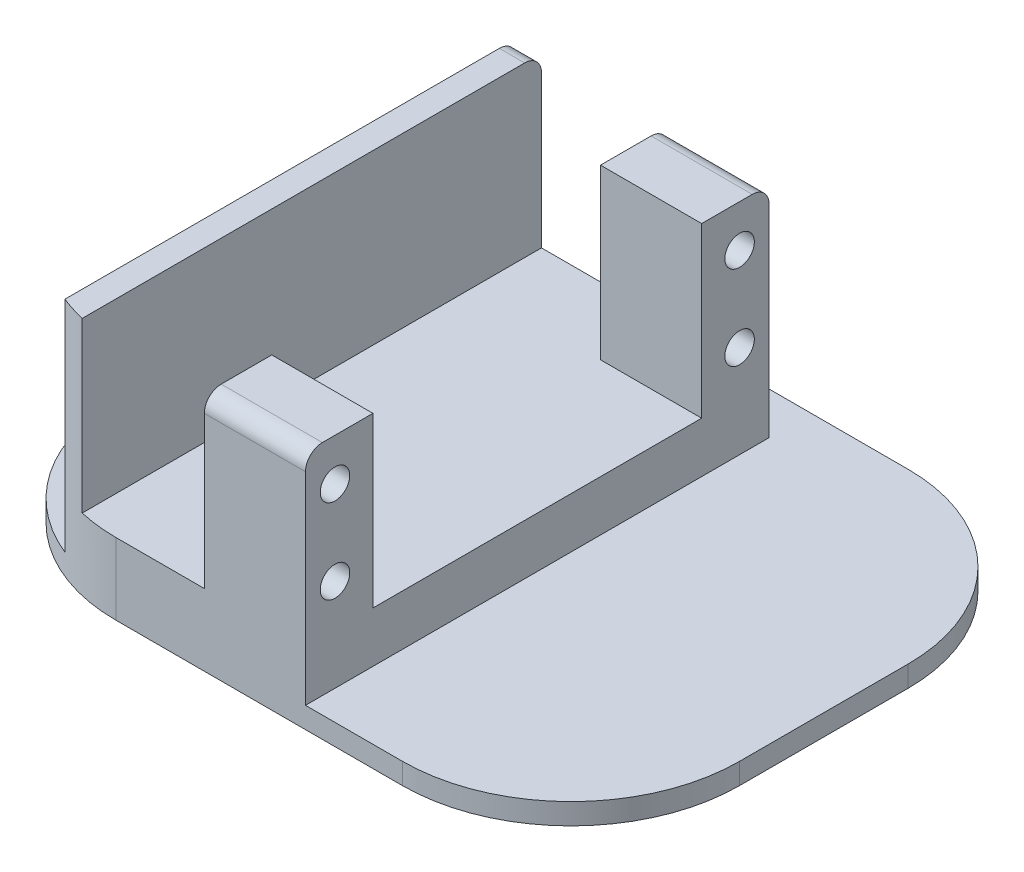
ISO-10303-21;
HEADER;
FILE_DESCRIPTION(('STEP AP214'),'2;1');
FILE_NAME('part.step','',(''),(''),'','','');
FILE_SCHEMA(('AUTOMOTIVE_DESIGN { 1 0 10303 214 1 1 1 1 }'));
ENDSEC;
DATA;
#1=APPLICATION_CONTEXT('core data for automotive mechanical design processes');
#2=APPLICATION_PROTOCOL_DEFINITION('international standard','automotive_design',2000,#1);
#3=PRODUCT_CONTEXT('',#1,'mechanical');
#4=PRODUCT('Part','Part','',(#3));
#5=PRODUCT_RELATED_PRODUCT_CATEGORY('part','',(#4));
#6=PRODUCT_DEFINITION_FORMATION('','',#4);
#7=PRODUCT_DEFINITION_CONTEXT('part definition',#1,'design');
#8=PRODUCT_DEFINITION('design','',#6,#7);
#9=PRODUCT_DEFINITION_SHAPE('','',#8);
#10=(LENGTH_UNIT() NAMED_UNIT(*) SI_UNIT(.MILLI.,.METRE.));
#11=(NAMED_UNIT(*) PLANE_ANGLE_UNIT() SI_UNIT($,.RADIAN.));
#12=(NAMED_UNIT(*) SI_UNIT($,.STERADIAN.) SOLID_ANGLE_UNIT());
#13=UNCERTAINTY_MEASURE_WITH_UNIT(LENGTH_MEASURE(1.E-05),#10,'distance_accuracy_value','');
#14=(GEOMETRIC_REPRESENTATION_CONTEXT(3) GLOBAL_UNCERTAINTY_ASSIGNED_CONTEXT((#13)) GLOBAL_UNIT_ASSIGNED_CONTEXT((#10,
#11,#12)) REPRESENTATION_CONTEXT('',''));
#15=CARTESIAN_POINT('',(0.,0.,0.));
#16=DIRECTION('',(0.,0.,1.));
#17=DIRECTION('',(1.,0.,0.));
#18=AXIS2_PLACEMENT_3D('',#15,#16,#17);
#19=CARTESIAN_POINT('',(12.5,8.5,-55.));
#20=DIRECTION('',(1.,0.,0.));
#21=DIRECTION('',(0.,0.,-1.));
#22=AXIS2_PLACEMENT_3D('',#19,#20,#21);
#23=PLANE('',#22);
#24=CARTESIAN_POINT('',(12.5,18.5,-18.));
#25=DIRECTION('',(1.,0.,0.));
#26=DIRECTION('',(0.,0.,-1.));
#27=AXIS2_PLACEMENT_3D('',#24,#25,#26);
#28=CIRCLE('',#27,3.95);
#29=CARTESIAN_POINT('',(12.5,18.5,-21.95));
#30=VERTEX_POINT('',#29);
#31=EDGE_CURVE('E725',#30,#30,#28,.T.);
#32=ORIENTED_EDGE('',*,*,#31,.T.);
#33=EDGE_LOOP('',(#32));
#34=FACE_BOUND('',#33,.T.);
#35=DIRECTION('',(0.,0.,1.));
#36=VECTOR('',#35,1.);
#37=CARTESIAN_POINT('',(12.5,28.5,-52.));
#38=LINE('',#37,#36);
#39=CARTESIAN_POINT('',(12.5,28.5,-53.));
#40=VERTEX_POINT('',#39);
#41=CARTESIAN_POINT('',(12.5,28.5,-1.45950378226084));
#42=VERTEX_POINT('',#41);
#43=EDGE_CURVE('E215',#40,#42,#38,.T.);
#44=ORIENTED_EDGE('',*,*,#43,.F.);
#45=CARTESIAN_POINT('',(12.5,26.5,-53.));
#46=DIRECTION('',(1.,0.,0.));
#47=DIRECTION('',(0.,0.,-1.));
#48=AXIS2_PLACEMENT_3D('',#45,#46,#47);
#49=CIRCLE('',#48,2.);
#50=CARTESIAN_POINT('',(12.5,26.5,-55.));
#51=VERTEX_POINT('',#50);
#52=EDGE_CURVE('E290',#40,#51,#49,.F.);
#53=ORIENTED_EDGE('',*,*,#52,.T.);
#54=DIRECTION('',(0.,-1.,0.));
#55=VECTOR('',#54,1.);
#56=CARTESIAN_POINT('',(12.5,8.5,-55.));
#57=LINE('',#56,#55);
#58=CARTESIAN_POINT('',(12.5,2.5,-55.));
#59=VERTEX_POINT('',#58);
#60=EDGE_CURVE('E266',#51,#59,#57,.T.);
#61=ORIENTED_EDGE('',*,*,#60,.T.);
#62=DIRECTION('',(0.,0.,1.));
#63=VECTOR('',#62,1.);
#64=CARTESIAN_POINT('',(12.5,2.5,-55.));
#65=LINE('',#64,#63);
#66=CARTESIAN_POINT('',(12.5,2.5,-1.45950378226084));
#67=VERTEX_POINT('',#66);
#68=EDGE_CURVE('E267',#59,#67,#65,.T.);
#69=ORIENTED_EDGE('',*,*,#68,.T.);
#70=DIRECTION('',(0.,-1.,0.));
#71=VECTOR('',#70,1.);
#72=CARTESIAN_POINT('',(12.5,2.5,-1.45950378226084));
#73=LINE('',#72,#71);
#74=EDGE_CURVE('E368',#67,#42,#73,.F.);
#75=ORIENTED_EDGE('',*,*,#74,.T.);
#76=EDGE_LOOP('',(#44,#53,#61,#69,#75));
#77=FACE_BOUND('',#76,.T.);
#78=ADVANCED_FACE('F33',(#34,#77),#23,.F.);
#79=CARTESIAN_POINT('',(0.,8.5,0.));
#80=DIRECTION('',(0.,1.,0.));
#81=DIRECTION('',(0.,0.,1.));
#82=AXIS2_PLACEMENT_3D('',#79,#80,#81);
#83=PLANE('',#82);
#84=DIRECTION('',(0.,0.,-1.));
#85=VECTOR('',#84,1.);
#86=CARTESIAN_POINT('',(15.5,8.5,-52.));
#87=LINE('',#86,#85);
#88=CARTESIAN_POINT('',(15.5,8.5,-0.512824730094924));
#89=VERTEX_POINT('',#88);
#90=CARTESIAN_POINT('',(15.5,8.5,-55.));
#91=VERTEX_POINT('',#90);
#92=EDGE_CURVE('E212',#89,#91,#87,.T.);
#93=ORIENTED_EDGE('',*,*,#92,.F.);
#94=CARTESIAN_POINT('',(20.,8.5,-20.));
#95=DIRECTION('',(0.,1.,0.));
#96=DIRECTION('',(0.,0.,1.));
#97=AXIS2_PLACEMENT_3D('',#94,#95,#96);
#98=CIRCLE('',#97,20.);
#99=CARTESIAN_POINT('',(20.,8.5,0.));
#100=VERTEX_POINT('',#99);
#101=EDGE_CURVE('E391',#89,#100,#98,.T.);
#102=ORIENTED_EDGE('',*,*,#101,.T.);
#103=DIRECTION('',(1.,0.,0.));
#104=VECTOR('',#103,1.);
#105=CARTESIAN_POINT('',(12.5,8.5,0.));
#106=LINE('',#105,#104);
#107=CARTESIAN_POINT('',(30.5,8.5,0.));
#108=VERTEX_POINT('',#107);
#109=EDGE_CURVE('E253',#100,#108,#106,.T.);
#110=ORIENTED_EDGE('',*,*,#109,.T.);
#111=DIRECTION('',(0.,0.,1.));
#112=VECTOR('',#111,1.);
#113=CARTESIAN_POINT('',(30.5,8.5,-8.));
#114=LINE('',#113,#112);
#115=CARTESIAN_POINT('',(30.5,8.5,-8.));
#116=VERTEX_POINT('',#115);
#117=EDGE_CURVE('E196',#116,#108,#114,.T.);
#118=ORIENTED_EDGE('',*,*,#117,.F.);
#119=DIRECTION('',(-1.,0.,0.));
#120=VECTOR('',#119,1.);
#121=CARTESIAN_POINT('',(30.5,8.5,-8.));
#122=LINE('',#121,#120);
#123=CARTESIAN_POINT('',(42.5,8.5,-8.));
#124=VERTEX_POINT('',#123);
#125=EDGE_CURVE('E750',#124,#116,#122,.T.);
#126=ORIENTED_EDGE('',*,*,#125,.F.);
#127=DIRECTION('',(0.,0.,-1.));
#128=VECTOR('',#127,1.);
#129=CARTESIAN_POINT('',(42.5,8.5,-55.));
#130=LINE('',#129,#128);
#131=CARTESIAN_POINT('',(42.5,8.5,-47.));
#132=VERTEX_POINT('',#131);
#133=EDGE_CURVE('E210',#124,#132,#130,.T.);
#134=ORIENTED_EDGE('',*,*,#133,.T.);
#135=DIRECTION('',(1.,0.,0.));
#136=VECTOR('',#135,1.);
#137=CARTESIAN_POINT('',(42.5,8.5,-47.));
#138=LINE('',#137,#136);
#139=CARTESIAN_POINT('',(30.5,8.5,-47.));
#140=VERTEX_POINT('',#139);
#141=EDGE_CURVE('E232',#140,#132,#138,.T.);
#142=ORIENTED_EDGE('',*,*,#141,.F.);
#143=DIRECTION('',(0.,0.,1.));
#144=VECTOR('',#143,1.);
#145=CARTESIAN_POINT('',(30.5,8.5,-47.));
#146=LINE('',#145,#144);
#147=CARTESIAN_POINT('',(30.5,8.5,-55.));
#148=VERTEX_POINT('',#147);
#149=EDGE_CURVE('E227',#148,#140,#146,.T.);
#150=ORIENTED_EDGE('',*,*,#149,.F.);
#151=DIRECTION('',(-1.,0.,0.));
#152=VECTOR('',#151,1.);
#153=CARTESIAN_POINT('',(12.5,8.5,-55.));
#154=LINE('',#153,#152);
#155=EDGE_CURVE('E252',#148,#91,#154,.T.);
#156=ORIENTED_EDGE('',*,*,#155,.T.);
#157=EDGE_LOOP('',(#93,#102,#110,#118,#126,#134,#142,#150,#156));
#158=FACE_BOUND('',#157,.T.);
#159=ADVANCED_FACE('F417',(#158),#83,.T.);
#160=CARTESIAN_POINT('',(0.,2.5,0.));
#161=DIRECTION('',(0.,-1.,0.));
#162=DIRECTION('',(0.,0.,-1.));
#163=AXIS2_PLACEMENT_3D('',#160,#161,#162);
#164=PLANE('',#163);
#165=DIRECTION('',(0.,0.,-1.));
#166=VECTOR('',#165,1.);
#167=CARTESIAN_POINT('',(74.,2.5,0.));
#168=LINE('',#167,#166);
#169=CARTESIAN_POINT('',(74.,2.5,-20.));
#170=VERTEX_POINT('',#169);
#171=CARTESIAN_POINT('',(74.,2.5,-40.));
#172=VERTEX_POINT('',#171);
#173=EDGE_CURVE('E320',#170,#172,#168,.T.);
#174=ORIENTED_EDGE('',*,*,#173,.T.);
#175=CARTESIAN_POINT('',(54.,2.5,-40.));
#176=DIRECTION('',(0.,-1.,0.));
#177=DIRECTION('',(0.,0.,-1.));
#178=AXIS2_PLACEMENT_3D('',#175,#176,#177);
#179=CIRCLE('',#178,20.);
#180=CARTESIAN_POINT('',(54.,2.5,-60.));
#181=VERTEX_POINT('',#180);
#182=EDGE_CURVE('E371',#172,#181,#179,.F.);
#183=ORIENTED_EDGE('',*,*,#182,.T.);
#184=DIRECTION('',(-1.,0.,0.));
#185=VECTOR('',#184,1.);
#186=CARTESIAN_POINT('',(0.,2.5,-60.));
#187=LINE('',#186,#185);
#188=CARTESIAN_POINT('',(20.,2.5,-60.));
#189=VERTEX_POINT('',#188);
#190=EDGE_CURVE('E330',#181,#189,#187,.T.);
#191=ORIENTED_EDGE('',*,*,#190,.T.);
#192=CARTESIAN_POINT('',(20.,2.5,-40.));
#193=DIRECTION('',(0.,-1.,0.));
#194=DIRECTION('',(0.,0.,-1.));
#195=AXIS2_PLACEMENT_3D('',#192,#193,#194);
#196=CIRCLE('',#195,20.);
#197=CARTESIAN_POINT('',(0.,2.5,-40.));
#198=VERTEX_POINT('',#197);
#199=EDGE_CURVE('E357',#189,#198,#196,.F.);
#200=ORIENTED_EDGE('',*,*,#199,.T.);
#201=DIRECTION('',(0.,0.,1.));
#202=VECTOR('',#201,1.);
#203=CARTESIAN_POINT('',(0.,2.5,0.));
#204=LINE('',#203,#202);
#205=CARTESIAN_POINT('',(0.,2.5,-20.));
#206=VERTEX_POINT('',#205);
#207=EDGE_CURVE('E321',#198,#206,#204,.T.);
#208=ORIENTED_EDGE('',*,*,#207,.T.);
#209=CARTESIAN_POINT('',(20.,2.5,-20.));
#210=DIRECTION('',(0.,-1.,0.));
#211=DIRECTION('',(0.,0.,-1.));
#212=AXIS2_PLACEMENT_3D('',#209,#210,#211);
#213=CIRCLE('',#212,20.);
#214=EDGE_CURVE('E355',#206,#67,#213,.F.);
#215=ORIENTED_EDGE('',*,*,#214,.T.);
#216=ORIENTED_EDGE('',*,*,#68,.F.);
#217=DIRECTION('',(-1.,0.,0.));
#218=VECTOR('',#217,1.);
#219=CARTESIAN_POINT('',(12.5,2.5,-55.));
#220=LINE('',#219,#218);
#221=CARTESIAN_POINT('',(42.5,2.5,-55.));
#222=VERTEX_POINT('',#221);
#223=EDGE_CURVE('E315',#222,#59,#220,.T.);
#224=ORIENTED_EDGE('',*,*,#223,.F.);
#225=DIRECTION('',(0.,0.,-1.));
#226=VECTOR('',#225,1.);
#227=CARTESIAN_POINT('',(42.5,2.5,-55.));
#228=LINE('',#227,#226);
#229=CARTESIAN_POINT('',(42.5,2.5,0.));
#230=VERTEX_POINT('',#229);
#231=EDGE_CURVE('E287',#230,#222,#228,.T.);
#232=ORIENTED_EDGE('',*,*,#231,.F.);
#233=DIRECTION('',(1.,0.,0.));
#234=VECTOR('',#233,1.);
#235=CARTESIAN_POINT('',(0.,2.5,0.));
#236=LINE('',#235,#234);
#237=CARTESIAN_POINT('',(54.,2.5,0.));
#238=VERTEX_POINT('',#237);
#239=EDGE_CURVE('E316',#230,#238,#236,.T.);
#240=ORIENTED_EDGE('',*,*,#239,.T.);
#241=CARTESIAN_POINT('',(54.,2.5,-20.));
#242=DIRECTION('',(0.,-1.,0.));
#243=DIRECTION('',(0.,0.,-1.));
#244=AXIS2_PLACEMENT_3D('',#241,#242,#243);
#245=CIRCLE('',#244,20.);
#246=EDGE_CURVE('E369',#238,#170,#245,.F.);
#247=ORIENTED_EDGE('',*,*,#246,.T.);
#248=EDGE_LOOP('',(#174,#183,#191,#200,#208,#215,#216,#224,#232,#240,#247));
#249=FACE_BOUND('',#248,.T.);
#250=ADVANCED_FACE('F353',(#249),#164,.F.);
#251=CARTESIAN_POINT('',(0.,2.5,0.));
#252=DIRECTION('',(1.,0.,0.));
#253=DIRECTION('',(0.,0.,-1.));
#254=AXIS2_PLACEMENT_3D('',#251,#252,#253);
#255=PLANE('',#254);
#256=DIRECTION('',(0.,0.,1.));
#257=VECTOR('',#256,1.);
#258=CARTESIAN_POINT('',(0.,0.,0.));
#259=LINE('',#258,#257);
#260=CARTESIAN_POINT('',(0.,0.,-40.));
#261=VERTEX_POINT('',#260);
#262=CARTESIAN_POINT('',(0.,0.,-20.));
#263=VERTEX_POINT('',#262);
#264=EDGE_CURVE('E306',#261,#263,#259,.T.);
#265=ORIENTED_EDGE('',*,*,#264,.T.);
#266=DIRECTION('',(0.,-1.,0.));
#267=VECTOR('',#266,1.);
#268=CARTESIAN_POINT('',(0.,2.5,-20.));
#269=LINE('',#268,#267);
#270=EDGE_CURVE('E365',#263,#206,#269,.F.);
#271=ORIENTED_EDGE('',*,*,#270,.T.);
#272=ORIENTED_EDGE('',*,*,#207,.F.);
#273=DIRECTION('',(0.,-1.,0.));
#274=VECTOR('',#273,1.);
#275=CARTESIAN_POINT('',(0.,2.5,-40.));
#276=LINE('',#275,#274);
#277=EDGE_CURVE('E383',#198,#261,#276,.T.);
#278=ORIENTED_EDGE('',*,*,#277,.T.);
#279=EDGE_LOOP('',(#265,#271,#272,#278));
#280=FACE_BOUND('',#279,.T.);
#281=ADVANCED_FACE('F449',(#280),#255,.F.);
#282=CARTESIAN_POINT('',(0.,2.5,0.));
#283=DIRECTION('',(0.,0.,-1.));
#284=DIRECTION('',(-1.,0.,0.));
#285=AXIS2_PLACEMENT_3D('',#282,#283,#284);
#286=PLANE('',#285);
#287=DIRECTION('',(0.,-1.,0.));
#288=VECTOR('',#287,1.);
#289=CARTESIAN_POINT('',(42.5,8.5,0.));
#290=LINE('',#289,#288);
#291=CARTESIAN_POINT('',(42.5,26.5,0.));
#292=VERTEX_POINT('',#291);
#293=EDGE_CURVE('E304',#292,#230,#290,.T.);
#294=ORIENTED_EDGE('',*,*,#293,.F.);
#295=DIRECTION('',(1.,0.,0.));
#296=VECTOR('',#295,1.);
#297=CARTESIAN_POINT('',(0.,26.5,0.));
#298=LINE('',#297,#296);
#299=CARTESIAN_POINT('',(30.5,26.5,0.));
#300=VERTEX_POINT('',#299);
#301=EDGE_CURVE('E41',#292,#300,#298,.F.);
#302=ORIENTED_EDGE('',*,*,#301,.T.);
#303=DIRECTION('',(0.,-1.,0.));
#304=VECTOR('',#303,1.);
#305=CARTESIAN_POINT('',(30.5,28.5,0.));
#306=LINE('',#305,#304);
#307=EDGE_CURVE('E217',#300,#108,#306,.T.);
#308=ORIENTED_EDGE('',*,*,#307,.T.);
#309=ORIENTED_EDGE('',*,*,#109,.F.);
#310=DIRECTION('',(0.,-1.,0.));
#311=VECTOR('',#310,1.);
#312=CARTESIAN_POINT('',(20.,2.5,0.));
#313=LINE('',#312,#311);
#314=CARTESIAN_POINT('',(20.,0.,0.));
#315=VERTEX_POINT('',#314);
#316=EDGE_CURVE('E378',#100,#315,#313,.T.);
#317=ORIENTED_EDGE('',*,*,#316,.T.);
#318=DIRECTION('',(1.,0.,0.));
#319=VECTOR('',#318,1.);
#320=CARTESIAN_POINT('',(0.,0.,0.));
#321=LINE('',#320,#319);
#322=CARTESIAN_POINT('',(54.,0.,0.));
#323=VERTEX_POINT('',#322);
#324=EDGE_CURVE('E336',#315,#323,#321,.T.);
#325=ORIENTED_EDGE('',*,*,#324,.T.);
#326=DIRECTION('',(0.,-1.,0.));
#327=VECTOR('',#326,1.);
#328=CARTESIAN_POINT('',(54.,2.5,0.));
#329=LINE('',#328,#327);
#330=EDGE_CURVE('E381',#323,#238,#329,.F.);
#331=ORIENTED_EDGE('',*,*,#330,.T.);
#332=ORIENTED_EDGE('',*,*,#239,.F.);
#333=EDGE_LOOP('',(#294,#302,#308,#309,#317,#325,#331,#332));
#334=FACE_BOUND('',#333,.T.);
#335=ADVANCED_FACE('F431',(#334),#286,.F.);
#336=CARTESIAN_POINT('',(74.,2.5,0.));
#337=DIRECTION('',(-1.,0.,0.));
#338=DIRECTION('',(0.,0.,1.));
#339=AXIS2_PLACEMENT_3D('',#336,#337,#338);
#340=PLANE('',#339);
#341=DIRECTION('',(0.,0.,-1.));
#342=VECTOR('',#341,1.);
#343=CARTESIAN_POINT('',(74.,0.,0.));
#344=LINE('',#343,#342);
#345=CARTESIAN_POINT('',(74.,0.,-20.));
#346=VERTEX_POINT('',#345);
#347=CARTESIAN_POINT('',(74.,0.,-40.));
#348=VERTEX_POINT('',#347);
#349=EDGE_CURVE('E338',#346,#348,#344,.T.);
#350=ORIENTED_EDGE('',*,*,#349,.T.);
#351=DIRECTION('',(0.,-1.,0.));
#352=VECTOR('',#351,1.);
#353=CARTESIAN_POINT('',(74.,2.5,-40.));
#354=LINE('',#353,#352);
#355=EDGE_CURVE('E373',#348,#172,#354,.F.);
#356=ORIENTED_EDGE('',*,*,#355,.T.);
#357=ORIENTED_EDGE('',*,*,#173,.F.);
#358=DIRECTION('',(0.,-1.,0.));
#359=VECTOR('',#358,1.);
#360=CARTESIAN_POINT('',(74.,2.5,-20.));
#361=LINE('',#360,#359);
#362=EDGE_CURVE('E739',#170,#346,#361,.T.);
#363=ORIENTED_EDGE('',*,*,#362,.T.);
#364=EDGE_LOOP('',(#350,#356,#357,#363));
#365=FACE_BOUND('',#364,.T.);
#366=ADVANCED_FACE('F457',(#365),#340,.F.);
#367=CARTESIAN_POINT('',(0.,2.5,-60.));
#368=DIRECTION('',(0.,0.,1.));
#369=DIRECTION('',(1.,0.,0.));
#370=AXIS2_PLACEMENT_3D('',#367,#368,#369);
#371=PLANE('',#370);
#372=ORIENTED_EDGE('',*,*,#190,.F.);
#373=DIRECTION('',(0.,-1.,0.));
#374=VECTOR('',#373,1.);
#375=CARTESIAN_POINT('',(54.,2.5,-60.));
#376=LINE('',#375,#374);
#377=CARTESIAN_POINT('',(54.,0.,-60.));
#378=VERTEX_POINT('',#377);
#379=EDGE_CURVE('E729',#181,#378,#376,.T.);
#380=ORIENTED_EDGE('',*,*,#379,.T.);
#381=DIRECTION('',(-1.,0.,0.));
#382=VECTOR('',#381,1.);
#383=CARTESIAN_POINT('',(0.,0.,-60.));
#384=LINE('',#383,#382);
#385=CARTESIAN_POINT('',(20.,0.,-60.));
#386=VERTEX_POINT('',#385);
#387=EDGE_CURVE('E322',#378,#386,#384,.T.);
#388=ORIENTED_EDGE('',*,*,#387,.T.);
#389=DIRECTION('',(0.,-1.,0.));
#390=VECTOR('',#389,1.);
#391=CARTESIAN_POINT('',(20.,2.5,-60.));
#392=LINE('',#391,#390);
#393=EDGE_CURVE('E727',#386,#189,#392,.F.);
#394=ORIENTED_EDGE('',*,*,#393,.T.);
#395=EDGE_LOOP('',(#372,#380,#388,#394));
#396=FACE_BOUND('',#395,.T.);
#397=ADVANCED_FACE('F453',(#396),#371,.F.);
#398=CARTESIAN_POINT('',(0.,0.,0.));
#399=DIRECTION('',(0.,-1.,0.));
#400=DIRECTION('',(0.,0.,-1.));
#401=AXIS2_PLACEMENT_3D('',#398,#399,#400);
#402=PLANE('',#401);
#403=ORIENTED_EDGE('',*,*,#387,.F.);
#404=CARTESIAN_POINT('',(54.,0.,-40.));
#405=DIRECTION('',(0.,-1.,0.));
#406=DIRECTION('',(0.,0.,-1.));
#407=AXIS2_PLACEMENT_3D('',#404,#405,#406);
#408=CIRCLE('',#407,20.);
#409=EDGE_CURVE('E737',#378,#348,#408,.T.);
#410=ORIENTED_EDGE('',*,*,#409,.T.);
#411=ORIENTED_EDGE('',*,*,#349,.F.);
#412=CARTESIAN_POINT('',(54.,0.,-20.));
#413=DIRECTION('',(0.,-1.,0.));
#414=DIRECTION('',(0.,0.,-1.));
#415=AXIS2_PLACEMENT_3D('',#412,#413,#414);
#416=CIRCLE('',#415,20.);
#417=EDGE_CURVE('E735',#346,#323,#416,.T.);
#418=ORIENTED_EDGE('',*,*,#417,.T.);
#419=ORIENTED_EDGE('',*,*,#324,.F.);
#420=CARTESIAN_POINT('',(20.,0.,-20.));
#421=DIRECTION('',(0.,-1.,0.));
#422=DIRECTION('',(0.,0.,-1.));
#423=AXIS2_PLACEMENT_3D('',#420,#421,#422);
#424=CIRCLE('',#423,20.);
#425=EDGE_CURVE('E733',#315,#263,#424,.T.);
#426=ORIENTED_EDGE('',*,*,#425,.T.);
#427=ORIENTED_EDGE('',*,*,#264,.F.);
#428=CARTESIAN_POINT('',(20.,0.,-40.));
#429=DIRECTION('',(0.,-1.,0.));
#430=DIRECTION('',(0.,0.,-1.));
#431=AXIS2_PLACEMENT_3D('',#428,#429,#430);
#432=CIRCLE('',#431,20.);
#433=EDGE_CURVE('E731',#261,#386,#432,.T.);
#434=ORIENTED_EDGE('',*,*,#433,.T.);
#435=EDGE_LOOP('',(#403,#410,#411,#418,#419,#426,#427,#434));
#436=FACE_BOUND('',#435,.T.);
#437=ADVANCED_FACE('F450',(#436),#402,.T.);
#438=CARTESIAN_POINT('',(42.5,8.5,-55.));
#439=DIRECTION('',(-1.,0.,0.));
#440=DIRECTION('',(0.,0.,1.));
#441=AXIS2_PLACEMENT_3D('',#438,#439,#440);
#442=PLANE('',#441);
#443=CARTESIAN_POINT('',(42.5,13.5,-51.5));
#444=DIRECTION('',(1.,0.,0.));
#445=DIRECTION('',(0.,0.,-1.));
#446=AXIS2_PLACEMENT_3D('',#443,#444,#445);
#447=CIRCLE('',#446,1.75);
#448=CARTESIAN_POINT('',(42.5,13.5,-53.25));
#449=VERTEX_POINT('',#448);
#450=EDGE_CURVE('E710',#449,#449,#447,.T.);
#451=ORIENTED_EDGE('',*,*,#450,.F.);
#452=EDGE_LOOP('',(#451));
#453=FACE_BOUND('',#452,.T.);
#454=CARTESIAN_POINT('',(42.5,23.5,-51.5));
#455=DIRECTION('',(1.,0.,0.));
#456=DIRECTION('',(0.,0.,-1.));
#457=AXIS2_PLACEMENT_3D('',#454,#455,#456);
#458=CIRCLE('',#457,1.75);
#459=CARTESIAN_POINT('',(42.5,23.5,-53.25));
#460=VERTEX_POINT('',#459);
#461=EDGE_CURVE('E714',#460,#460,#458,.T.);
#462=ORIENTED_EDGE('',*,*,#461,.F.);
#463=EDGE_LOOP('',(#462));
#464=FACE_BOUND('',#463,.T.);
#465=CARTESIAN_POINT('',(42.5,13.5,-3.5));
#466=DIRECTION('',(1.,0.,0.));
#467=DIRECTION('',(0.,0.,-1.));
#468=AXIS2_PLACEMENT_3D('',#465,#466,#467);
#469=CIRCLE('',#468,1.75);
#470=CARTESIAN_POINT('',(42.5,13.5,-5.25));
#471=VERTEX_POINT('',#470);
#472=EDGE_CURVE('E759',#471,#471,#469,.T.);
#473=ORIENTED_EDGE('',*,*,#472,.F.);
#474=EDGE_LOOP('',(#473));
#475=FACE_BOUND('',#474,.T.);
#476=CARTESIAN_POINT('',(42.5,23.5,-3.5));
#477=DIRECTION('',(1.,0.,0.));
#478=DIRECTION('',(0.,0.,-1.));
#479=AXIS2_PLACEMENT_3D('',#476,#477,#478);
#480=CIRCLE('',#479,1.75);
#481=CARTESIAN_POINT('',(42.5,23.5,-5.25));
#482=VERTEX_POINT('',#481);
#483=EDGE_CURVE('E755',#482,#482,#480,.T.);
#484=ORIENTED_EDGE('',*,*,#483,.F.);
#485=EDGE_LOOP('',(#484));
#486=FACE_BOUND('',#485,.T.);
#487=DIRECTION('',(0.,-1.,0.));
#488=VECTOR('',#487,1.);
#489=CARTESIAN_POINT('',(42.5,8.5,-55.));
#490=LINE('',#489,#488);
#491=CARTESIAN_POINT('',(42.5,26.5,-55.));
#492=VERTEX_POINT('',#491);
#493=EDGE_CURVE('E307',#492,#222,#490,.T.);
#494=ORIENTED_EDGE('',*,*,#493,.F.);
#495=CARTESIAN_POINT('',(42.5,26.5,-53.));
#496=DIRECTION('',(-1.,0.,0.));
#497=DIRECTION('',(0.,0.,1.));
#498=AXIS2_PLACEMENT_3D('',#495,#496,#497);
#499=CIRCLE('',#498,2.);
#500=CARTESIAN_POINT('',(42.5,28.5,-53.));
#501=VERTEX_POINT('',#500);
#502=EDGE_CURVE('E425',#492,#501,#499,.F.);
#503=ORIENTED_EDGE('',*,*,#502,.T.);
#504=DIRECTION('',(0.,0.,-1.));
#505=VECTOR('',#504,1.);
#506=CARTESIAN_POINT('',(42.5,28.5,-55.));
#507=LINE('',#506,#505);
#508=CARTESIAN_POINT('',(42.5,28.5,-47.));
#509=VERTEX_POINT('',#508);
#510=EDGE_CURVE('E228',#509,#501,#507,.T.);
#511=ORIENTED_EDGE('',*,*,#510,.F.);
#512=DIRECTION('',(0.,-1.,0.));
#513=VECTOR('',#512,1.);
#514=CARTESIAN_POINT('',(42.5,28.5,-47.));
#515=LINE('',#514,#513);
#516=EDGE_CURVE('E236',#509,#132,#515,.T.);
#517=ORIENTED_EDGE('',*,*,#516,.T.);
#518=ORIENTED_EDGE('',*,*,#133,.F.);
#519=DIRECTION('',(0.,-1.,0.));
#520=VECTOR('',#519,1.);
#521=CARTESIAN_POINT('',(42.5,28.5,-8.));
#522=LINE('',#521,#520);
#523=CARTESIAN_POINT('',(42.5,28.5,-8.));
#524=VERTEX_POINT('',#523);
#525=EDGE_CURVE('E202',#524,#124,#522,.T.);
#526=ORIENTED_EDGE('',*,*,#525,.F.);
#527=DIRECTION('',(0.,0.,-1.));
#528=VECTOR('',#527,1.);
#529=CARTESIAN_POINT('',(42.5,28.5,0.));
#530=LINE('',#529,#528);
#531=CARTESIAN_POINT('',(42.5,28.5,-2.));
#532=VERTEX_POINT('',#531);
#533=EDGE_CURVE('E187',#532,#524,#530,.T.);
#534=ORIENTED_EDGE('',*,*,#533,.F.);
#535=CARTESIAN_POINT('',(42.5,26.5,-2.));
#536=DIRECTION('',(-1.,0.,0.));
#537=DIRECTION('',(0.,0.,1.));
#538=AXIS2_PLACEMENT_3D('',#535,#536,#537);
#539=CIRCLE('',#538,2.);
#540=EDGE_CURVE('E303',#532,#292,#539,.F.);
#541=ORIENTED_EDGE('',*,*,#540,.T.);
#542=ORIENTED_EDGE('',*,*,#293,.T.);
#543=ORIENTED_EDGE('',*,*,#231,.T.);
#544=EDGE_LOOP('',(#494,#503,#511,#517,#518,#526,#534,#541,#542,#543));
#545=FACE_BOUND('',#544,.T.);
#546=ADVANCED_FACE('F208',(#453,#464,#475,#486,#545),#442,.F.);
#547=CARTESIAN_POINT('',(12.5,8.5,-55.));
#548=DIRECTION('',(0.,0.,1.));
#549=DIRECTION('',(1.,0.,0.));
#550=AXIS2_PLACEMENT_3D('',#547,#548,#549);
#551=PLANE('',#550);
#552=ORIENTED_EDGE('',*,*,#60,.F.);
#553=DIRECTION('',(-1.,0.,0.));
#554=VECTOR('',#553,1.);
#555=CARTESIAN_POINT('',(15.5,26.5,-55.));
#556=LINE('',#555,#554);
#557=CARTESIAN_POINT('',(15.5,26.5,-55.));
#558=VERTEX_POINT('',#557);
#559=EDGE_CURVE('E294',#51,#558,#556,.F.);
#560=ORIENTED_EDGE('',*,*,#559,.T.);
#561=DIRECTION('',(0.,-1.,0.));
#562=VECTOR('',#561,1.);
#563=CARTESIAN_POINT('',(15.5,28.5,-55.));
#564=LINE('',#563,#562);
#565=EDGE_CURVE('E224',#558,#91,#564,.T.);
#566=ORIENTED_EDGE('',*,*,#565,.T.);
#567=ORIENTED_EDGE('',*,*,#155,.F.);
#568=DIRECTION('',(0.,-1.,0.));
#569=VECTOR('',#568,1.);
#570=CARTESIAN_POINT('',(30.5,28.5,-55.));
#571=LINE('',#570,#569);
#572=CARTESIAN_POINT('',(30.5,26.5,-55.));
#573=VERTEX_POINT('',#572);
#574=EDGE_CURVE('E279',#573,#148,#571,.T.);
#575=ORIENTED_EDGE('',*,*,#574,.F.);
#576=DIRECTION('',(-1.,0.,0.));
#577=VECTOR('',#576,1.);
#578=CARTESIAN_POINT('',(12.5,26.5,-55.));
#579=LINE('',#578,#577);
#580=EDGE_CURVE('E292',#573,#492,#579,.F.);
#581=ORIENTED_EDGE('',*,*,#580,.T.);
#582=ORIENTED_EDGE('',*,*,#493,.T.);
#583=ORIENTED_EDGE('',*,*,#223,.T.);
#584=EDGE_LOOP('',(#552,#560,#566,#567,#575,#581,#582,#583));
#585=FACE_BOUND('',#584,.T.);
#586=ADVANCED_FACE('F403',(#585),#551,.F.);
#587=CARTESIAN_POINT('',(30.5,28.5,-47.));
#588=DIRECTION('',(1.,0.,0.));
#589=DIRECTION('',(0.,0.,-1.));
#590=AXIS2_PLACEMENT_3D('',#587,#588,#589);
#591=PLANE('',#590);
#592=CARTESIAN_POINT('',(30.5,13.5,-51.5));
#593=DIRECTION('',(1.,0.,0.));
#594=DIRECTION('',(0.,0.,-1.));
#595=AXIS2_PLACEMENT_3D('',#592,#593,#594);
#596=CIRCLE('',#595,1.75);
#597=CARTESIAN_POINT('',(30.5,13.5,-53.25));
#598=VERTEX_POINT('',#597);
#599=EDGE_CURVE('E713',#598,#598,#596,.T.);
#600=ORIENTED_EDGE('',*,*,#599,.T.);
#601=EDGE_LOOP('',(#600));
#602=FACE_BOUND('',#601,.T.);
#603=CARTESIAN_POINT('',(30.5,23.5,-51.5));
#604=DIRECTION('',(1.,0.,0.));
#605=DIRECTION('',(0.,0.,-1.));
#606=AXIS2_PLACEMENT_3D('',#603,#604,#605);
#607=CIRCLE('',#606,1.75);
#608=CARTESIAN_POINT('',(30.5,23.5,-53.25));
#609=VERTEX_POINT('',#608);
#610=EDGE_CURVE('E717',#609,#609,#607,.T.);
#611=ORIENTED_EDGE('',*,*,#610,.T.);
#612=EDGE_LOOP('',(#611));
#613=FACE_BOUND('',#612,.T.);
#614=DIRECTION('',(0.,0.,1.));
#615=VECTOR('',#614,1.);
#616=CARTESIAN_POINT('',(30.5,28.5,-47.));
#617=LINE('',#616,#615);
#618=CARTESIAN_POINT('',(30.5,28.5,-53.));
#619=VERTEX_POINT('',#618);
#620=CARTESIAN_POINT('',(30.5,28.5,-47.));
#621=VERTEX_POINT('',#620);
#622=EDGE_CURVE('E231',#619,#621,#617,.T.);
#623=ORIENTED_EDGE('',*,*,#622,.F.);
#624=CARTESIAN_POINT('',(30.5,26.5,-53.));
#625=DIRECTION('',(1.,0.,0.));
#626=DIRECTION('',(0.,0.,-1.));
#627=AXIS2_PLACEMENT_3D('',#624,#625,#626);
#628=CIRCLE('',#627,2.);
#629=EDGE_CURVE('E301',#619,#573,#628,.F.);
#630=ORIENTED_EDGE('',*,*,#629,.T.);
#631=ORIENTED_EDGE('',*,*,#574,.T.);
#632=ORIENTED_EDGE('',*,*,#149,.T.);
#633=DIRECTION('',(0.,-1.,0.));
#634=VECTOR('',#633,1.);
#635=CARTESIAN_POINT('',(30.5,28.5,-47.));
#636=LINE('',#635,#634);
#637=EDGE_CURVE('E239',#621,#140,#636,.T.);
#638=ORIENTED_EDGE('',*,*,#637,.F.);
#639=EDGE_LOOP('',(#623,#630,#631,#632,#638));
#640=FACE_BOUND('',#639,.T.);
#641=ADVANCED_FACE('F276',(#602,#613,#640),#591,.F.);
#642=CARTESIAN_POINT('',(42.5,28.5,-47.));
#643=DIRECTION('',(0.,0.,-1.));
#644=DIRECTION('',(-1.,0.,0.));
#645=AXIS2_PLACEMENT_3D('',#642,#643,#644);
#646=PLANE('',#645);
#647=ORIENTED_EDGE('',*,*,#141,.T.);
#648=ORIENTED_EDGE('',*,*,#516,.F.);
#649=DIRECTION('',(1.,0.,0.));
#650=VECTOR('',#649,1.);
#651=CARTESIAN_POINT('',(42.5,28.5,-47.));
#652=LINE('',#651,#650);
#653=EDGE_CURVE('E234',#621,#509,#652,.T.);
#654=ORIENTED_EDGE('',*,*,#653,.F.);
#655=ORIENTED_EDGE('',*,*,#637,.T.);
#656=EDGE_LOOP('',(#647,#648,#654,#655));
#657=FACE_BOUND('',#656,.T.);
#658=ADVANCED_FACE('F283',(#657),#646,.F.);
#659=CARTESIAN_POINT('',(0.,28.5,0.));
#660=DIRECTION('',(0.,-1.,0.));
#661=DIRECTION('',(0.,0.,-1.));
#662=AXIS2_PLACEMENT_3D('',#659,#660,#661);
#663=PLANE('',#662);
#664=ORIENTED_EDGE('',*,*,#510,.T.);
#665=DIRECTION('',(-1.,0.,0.));
#666=VECTOR('',#665,1.);
#667=CARTESIAN_POINT('',(0.,28.5,-53.));
#668=LINE('',#667,#666);
#669=EDGE_CURVE('E298',#501,#619,#668,.T.);
#670=ORIENTED_EDGE('',*,*,#669,.T.);
#671=ORIENTED_EDGE('',*,*,#622,.T.);
#672=ORIENTED_EDGE('',*,*,#653,.T.);
#673=EDGE_LOOP('',(#664,#670,#671,#672));
#674=FACE_BOUND('',#673,.T.);
#675=ADVANCED_FACE('F595',(#674),#663,.F.);
#676=CARTESIAN_POINT('',(15.5,28.5,-52.));
#677=DIRECTION('',(-1.,0.,0.));
#678=DIRECTION('',(0.,0.,1.));
#679=AXIS2_PLACEMENT_3D('',#676,#677,#678);
#680=PLANE('',#679);
#681=ORIENTED_EDGE('',*,*,#565,.F.);
#682=CARTESIAN_POINT('',(15.5,26.5,-53.));
#683=DIRECTION('',(-1.,0.,0.));
#684=DIRECTION('',(0.,0.,1.));
#685=AXIS2_PLACEMENT_3D('',#682,#683,#684);
#686=CIRCLE('',#685,2.);
#687=CARTESIAN_POINT('',(15.5,28.5,-53.));
#688=VERTEX_POINT('',#687);
#689=EDGE_CURVE('E296',#558,#688,#686,.F.);
#690=ORIENTED_EDGE('',*,*,#689,.T.);
#691=DIRECTION('',(0.,0.,-1.));
#692=VECTOR('',#691,1.);
#693=CARTESIAN_POINT('',(15.5,28.5,-13.));
#694=LINE('',#693,#692);
#695=CARTESIAN_POINT('',(15.5,28.5,-0.512824730094929));
#696=VERTEX_POINT('',#695);
#697=EDGE_CURVE('E222',#696,#688,#694,.T.);
#698=ORIENTED_EDGE('',*,*,#697,.F.);
#699=DIRECTION('',(0.,-1.,0.));
#700=VECTOR('',#699,1.);
#701=CARTESIAN_POINT('',(15.5,28.5,-0.512824730094924));
#702=LINE('',#701,#700);
#703=EDGE_CURVE('E389',#696,#89,#702,.T.);
#704=ORIENTED_EDGE('',*,*,#703,.T.);
#705=ORIENTED_EDGE('',*,*,#92,.T.);
#706=EDGE_LOOP('',(#681,#690,#698,#704,#705));
#707=FACE_BOUND('',#706,.T.);
#708=ADVANCED_FACE('F411',(#707),#680,.F.);
#709=CARTESIAN_POINT('',(0.,28.5,0.));
#710=DIRECTION('',(0.,1.,0.));
#711=DIRECTION('',(0.,0.,1.));
#712=AXIS2_PLACEMENT_3D('',#709,#710,#711);
#713=PLANE('',#712);
#714=ORIENTED_EDGE('',*,*,#697,.T.);
#715=DIRECTION('',(-1.,0.,0.));
#716=VECTOR('',#715,1.);
#717=CARTESIAN_POINT('',(12.5,28.5,-53.));
#718=LINE('',#717,#716);
#719=EDGE_CURVE('E392',#688,#40,#718,.T.);
#720=ORIENTED_EDGE('',*,*,#719,.T.);
#721=ORIENTED_EDGE('',*,*,#43,.T.);
#722=CARTESIAN_POINT('',(20.,28.5,-20.));
#723=DIRECTION('',(0.,1.,0.));
#724=DIRECTION('',(0.,0.,1.));
#725=AXIS2_PLACEMENT_3D('',#722,#723,#724);
#726=CIRCLE('',#725,20.);
#727=EDGE_CURVE('E387',#42,#696,#726,.T.);
#728=ORIENTED_EDGE('',*,*,#727,.T.);
#729=EDGE_LOOP('',(#714,#720,#721,#728));
#730=FACE_BOUND('',#729,.T.);
#731=ADVANCED_FACE('F413',(#730),#713,.T.);
#732=CARTESIAN_POINT('',(30.5,28.5,-8.));
#733=DIRECTION('',(0.,0.,1.));
#734=DIRECTION('',(1.,0.,0.));
#735=AXIS2_PLACEMENT_3D('',#732,#733,#734);
#736=PLANE('',#735);
#737=ORIENTED_EDGE('',*,*,#125,.T.);
#738=DIRECTION('',(0.,-1.,0.));
#739=VECTOR('',#738,1.);
#740=CARTESIAN_POINT('',(30.5,28.5,-8.));
#741=LINE('',#740,#739);
#742=CARTESIAN_POINT('',(30.5,28.5,-8.));
#743=VERTEX_POINT('',#742);
#744=EDGE_CURVE('E204',#743,#116,#741,.T.);
#745=ORIENTED_EDGE('',*,*,#744,.F.);
#746=DIRECTION('',(-1.,0.,0.));
#747=VECTOR('',#746,1.);
#748=CARTESIAN_POINT('',(30.5,28.5,-8.));
#749=LINE('',#748,#747);
#750=EDGE_CURVE('E190',#524,#743,#749,.T.);
#751=ORIENTED_EDGE('',*,*,#750,.F.);
#752=ORIENTED_EDGE('',*,*,#525,.T.);
#753=EDGE_LOOP('',(#737,#745,#751,#752));
#754=FACE_BOUND('',#753,.T.);
#755=ADVANCED_FACE('F201',(#754),#736,.F.);
#756=CARTESIAN_POINT('',(30.5,28.5,-8.));
#757=DIRECTION('',(1.,0.,0.));
#758=DIRECTION('',(0.,0.,-1.));
#759=AXIS2_PLACEMENT_3D('',#756,#757,#758);
#760=PLANE('',#759);
#761=CARTESIAN_POINT('',(30.5,13.5,-3.5));
#762=DIRECTION('',(1.,0.,0.));
#763=DIRECTION('',(0.,0.,-1.));
#764=AXIS2_PLACEMENT_3D('',#761,#762,#763);
#765=CIRCLE('',#764,1.75);
#766=CARTESIAN_POINT('',(30.5,13.5,-5.25));
#767=VERTEX_POINT('',#766);
#768=EDGE_CURVE('E758',#767,#767,#765,.T.);
#769=ORIENTED_EDGE('',*,*,#768,.T.);
#770=EDGE_LOOP('',(#769));
#771=FACE_BOUND('',#770,.T.);
#772=CARTESIAN_POINT('',(30.5,23.5,-3.5));
#773=DIRECTION('',(1.,0.,0.));
#774=DIRECTION('',(0.,0.,-1.));
#775=AXIS2_PLACEMENT_3D('',#772,#773,#774);
#776=CIRCLE('',#775,1.75);
#777=CARTESIAN_POINT('',(30.5,23.5,-5.25));
#778=VERTEX_POINT('',#777);
#779=EDGE_CURVE('E254',#778,#778,#776,.T.);
#780=ORIENTED_EDGE('',*,*,#779,.T.);
#781=EDGE_LOOP('',(#780));
#782=FACE_BOUND('',#781,.T.);
#783=ORIENTED_EDGE('',*,*,#307,.F.);
#784=CARTESIAN_POINT('',(30.5,26.5,-2.));
#785=DIRECTION('',(1.,0.,0.));
#786=DIRECTION('',(0.,0.,-1.));
#787=AXIS2_PLACEMENT_3D('',#784,#785,#786);
#788=CIRCLE('',#787,2.);
#789=CARTESIAN_POINT('',(30.5,28.5,-2.));
#790=VERTEX_POINT('',#789);
#791=EDGE_CURVE('E11',#300,#790,#788,.F.);
#792=ORIENTED_EDGE('',*,*,#791,.T.);
#793=DIRECTION('',(0.,0.,1.));
#794=VECTOR('',#793,1.);
#795=CARTESIAN_POINT('',(30.5,28.5,-8.));
#796=LINE('',#795,#794);
#797=EDGE_CURVE('E205',#743,#790,#796,.T.);
#798=ORIENTED_EDGE('',*,*,#797,.F.);
#799=ORIENTED_EDGE('',*,*,#744,.T.);
#800=ORIENTED_EDGE('',*,*,#117,.T.);
#801=EDGE_LOOP('',(#783,#792,#798,#799,#800));
#802=FACE_BOUND('',#801,.T.);
#803=ADVANCED_FACE('F627',(#771,#782,#802),#760,.F.);
#804=CARTESIAN_POINT('',(0.,28.5,0.));
#805=DIRECTION('',(0.,-1.,0.));
#806=DIRECTION('',(0.,0.,-1.));
#807=AXIS2_PLACEMENT_3D('',#804,#805,#806);
#808=PLANE('',#807);
#809=ORIENTED_EDGE('',*,*,#797,.T.);
#810=DIRECTION('',(1.,0.,0.));
#811=VECTOR('',#810,1.);
#812=CARTESIAN_POINT('',(0.,28.5,-2.));
#813=LINE('',#812,#811);
#814=EDGE_CURVE('E193',#790,#532,#813,.T.);
#815=ORIENTED_EDGE('',*,*,#814,.T.);
#816=ORIENTED_EDGE('',*,*,#533,.T.);
#817=ORIENTED_EDGE('',*,*,#750,.T.);
#818=EDGE_LOOP('',(#809,#815,#816,#817));
#819=FACE_BOUND('',#818,.T.);
#820=ADVANCED_FACE('F189',(#819),#808,.F.);
#821=CARTESIAN_POINT('',(22.5,23.5,-3.5));
#822=DIRECTION('',(1.,0.,0.));
#823=DIRECTION('',(0.,0.,-1.));
#824=AXIS2_PLACEMENT_3D('',#821,#822,#823);
#825=CYLINDRICAL_SURFACE('',#824,1.75);
#826=ORIENTED_EDGE('',*,*,#483,.T.);
#827=EDGE_LOOP('',(#826));
#828=FACE_BOUND('',#827,.T.);
#829=ORIENTED_EDGE('',*,*,#779,.F.);
#830=EDGE_LOOP('',(#829));
#831=FACE_BOUND('',#830,.T.);
#832=ADVANCED_FACE('F640',(#828,#831),#825,.F.);
#833=CARTESIAN_POINT('',(22.5,13.5,-3.5));
#834=DIRECTION('',(1.,0.,0.));
#835=DIRECTION('',(0.,0.,-1.));
#836=AXIS2_PLACEMENT_3D('',#833,#834,#835);
#837=CYLINDRICAL_SURFACE('',#836,1.75);
#838=ORIENTED_EDGE('',*,*,#472,.T.);
#839=EDGE_LOOP('',(#838));
#840=FACE_BOUND('',#839,.T.);
#841=ORIENTED_EDGE('',*,*,#768,.F.);
#842=EDGE_LOOP('',(#841));
#843=FACE_BOUND('',#842,.T.);
#844=ADVANCED_FACE('F650',(#840,#843),#837,.F.);
#845=CARTESIAN_POINT('',(22.5,23.5,-51.5));
#846=DIRECTION('',(1.,0.,0.));
#847=DIRECTION('',(0.,0.,-1.));
#848=AXIS2_PLACEMENT_3D('',#845,#846,#847);
#849=CYLINDRICAL_SURFACE('',#848,1.75);
#850=ORIENTED_EDGE('',*,*,#461,.T.);
#851=EDGE_LOOP('',(#850));
#852=FACE_BOUND('',#851,.T.);
#853=ORIENTED_EDGE('',*,*,#610,.F.);
#854=EDGE_LOOP('',(#853));
#855=FACE_BOUND('',#854,.T.);
#856=ADVANCED_FACE('F658',(#852,#855),#849,.F.);
#857=CARTESIAN_POINT('',(22.5,13.5,-51.5));
#858=DIRECTION('',(1.,0.,0.));
#859=DIRECTION('',(0.,0.,-1.));
#860=AXIS2_PLACEMENT_3D('',#857,#858,#859);
#861=CYLINDRICAL_SURFACE('',#860,1.75);
#862=ORIENTED_EDGE('',*,*,#450,.T.);
#863=EDGE_LOOP('',(#862));
#864=FACE_BOUND('',#863,.T.);
#865=ORIENTED_EDGE('',*,*,#599,.F.);
#866=EDGE_LOOP('',(#865));
#867=FACE_BOUND('',#866,.T.);
#868=ADVANCED_FACE('F548',(#864,#867),#861,.F.);
#869=CARTESIAN_POINT('',(7.50000000000001,18.5,-18.));
#870=DIRECTION('',(1.,0.,0.));
#871=DIRECTION('',(0.,0.,-1.));
#872=AXIS2_PLACEMENT_3D('',#869,#870,#871);
#873=CYLINDRICAL_SURFACE('',#872,2.95);
#874=CARTESIAN_POINT('',(11.5,18.5,-18.));
#875=DIRECTION('',(1.,0.,0.));
#876=DIRECTION('',(0.,0.,-1.));
#877=AXIS2_PLACEMENT_3D('',#874,#875,#876);
#878=CIRCLE('',#877,2.95);
#879=CARTESIAN_POINT('',(11.5,18.5,-20.95));
#880=VERTEX_POINT('',#879);
#881=EDGE_CURVE('E333',#880,#880,#878,.F.);
#882=ORIENTED_EDGE('',*,*,#881,.T.);
#883=EDGE_LOOP('',(#882));
#884=FACE_BOUND('',#883,.T.);
#885=CARTESIAN_POINT('',(7.50000000000001,18.5,-18.));
#886=DIRECTION('',(-1.,0.,0.));
#887=DIRECTION('',(0.,0.,1.));
#888=AXIS2_PLACEMENT_3D('',#885,#886,#887);
#889=CIRCLE('',#888,2.95);
#890=CARTESIAN_POINT('',(7.50000000000001,18.5,-15.05));
#891=VERTEX_POINT('',#890);
#892=EDGE_CURVE('E719',#891,#891,#889,.T.);
#893=ORIENTED_EDGE('',*,*,#892,.F.);
#894=EDGE_LOOP('',(#893));
#895=FACE_BOUND('',#894,.T.);
#896=ADVANCED_FACE('F539',(#884,#895),#873,.T.);
#897=CARTESIAN_POINT('',(7.50000000000001,18.5,-18.));
#898=DIRECTION('',(-1.,0.,0.));
#899=DIRECTION('',(0.,0.,1.));
#900=AXIS2_PLACEMENT_3D('',#897,#898,#899);
#901=PLANE('',#900);
#902=ORIENTED_EDGE('',*,*,#892,.T.);
#903=EDGE_LOOP('',(#902));
#904=FACE_BOUND('',#903,.T.);
#905=ADVANCED_FACE('F468',(#904),#901,.T.);
#906=CARTESIAN_POINT('',(11.5,18.5,-18.));
#907=DIRECTION('',(1.,0.,0.));
#908=DIRECTION('',(0.,0.,-1.));
#909=AXIS2_PLACEMENT_3D('',#906,#907,#908);
#910=TOROIDAL_SURFACE('',#909,3.95,1.);
#911=ORIENTED_EDGE('',*,*,#31,.F.);
#912=EDGE_LOOP('',(#911));
#913=FACE_BOUND('',#912,.T.);
#914=ORIENTED_EDGE('',*,*,#881,.F.);
#915=EDGE_LOOP('',(#914));
#916=FACE_BOUND('',#915,.T.);
#917=ADVANCED_FACE('F464',(#913,#916),#910,.F.);
#918=CARTESIAN_POINT('',(54.,2.5,-40.));
#919=DIRECTION('',(0.,-1.,0.));
#920=DIRECTION('',(0.,0.,-1.));
#921=AXIS2_PLACEMENT_3D('',#918,#919,#920);
#922=CYLINDRICAL_SURFACE('',#921,20.);
#923=ORIENTED_EDGE('',*,*,#182,.F.);
#924=ORIENTED_EDGE('',*,*,#355,.F.);
#925=ORIENTED_EDGE('',*,*,#409,.F.);
#926=ORIENTED_EDGE('',*,*,#379,.F.);
#927=EDGE_LOOP('',(#923,#924,#925,#926));
#928=FACE_BOUND('',#927,.T.);
#929=ADVANCED_FACE('F467',(#928),#922,.T.);
#930=CARTESIAN_POINT('',(54.,2.5,-20.));
#931=DIRECTION('',(0.,-1.,0.));
#932=DIRECTION('',(0.,0.,-1.));
#933=AXIS2_PLACEMENT_3D('',#930,#931,#932);
#934=CYLINDRICAL_SURFACE('',#933,20.);
#935=ORIENTED_EDGE('',*,*,#246,.F.);
#936=ORIENTED_EDGE('',*,*,#330,.F.);
#937=ORIENTED_EDGE('',*,*,#417,.F.);
#938=ORIENTED_EDGE('',*,*,#362,.F.);
#939=EDGE_LOOP('',(#935,#936,#937,#938));
#940=FACE_BOUND('',#939,.T.);
#941=ADVANCED_FACE('F472',(#940),#934,.T.);
#942=CARTESIAN_POINT('',(20.,2.5,-20.));
#943=DIRECTION('',(0.,-1.,0.));
#944=DIRECTION('',(0.,0.,-1.));
#945=AXIS2_PLACEMENT_3D('',#942,#943,#944);
#946=CYLINDRICAL_SURFACE('',#945,20.);
#947=ORIENTED_EDGE('',*,*,#214,.F.);
#948=ORIENTED_EDGE('',*,*,#270,.F.);
#949=ORIENTED_EDGE('',*,*,#425,.F.);
#950=ORIENTED_EDGE('',*,*,#316,.F.);
#951=ORIENTED_EDGE('',*,*,#101,.F.);
#952=ORIENTED_EDGE('',*,*,#703,.F.);
#953=ORIENTED_EDGE('',*,*,#727,.F.);
#954=ORIENTED_EDGE('',*,*,#74,.F.);
#955=EDGE_LOOP('',(#947,#948,#949,#950,#951,#952,#953,#954));
#956=FACE_BOUND('',#955,.T.);
#957=ADVANCED_FACE('F364',(#956),#946,.T.);
#958=CARTESIAN_POINT('',(20.,2.5,-40.));
#959=DIRECTION('',(0.,-1.,0.));
#960=DIRECTION('',(0.,0.,-1.));
#961=AXIS2_PLACEMENT_3D('',#958,#959,#960);
#962=CYLINDRICAL_SURFACE('',#961,20.);
#963=ORIENTED_EDGE('',*,*,#199,.F.);
#964=ORIENTED_EDGE('',*,*,#393,.F.);
#965=ORIENTED_EDGE('',*,*,#433,.F.);
#966=ORIENTED_EDGE('',*,*,#277,.F.);
#967=EDGE_LOOP('',(#963,#964,#965,#966));
#968=FACE_BOUND('',#967,.T.);
#969=ADVANCED_FACE('F479',(#968),#962,.T.);
#970=CARTESIAN_POINT('',(0.,26.5,-53.));
#971=DIRECTION('',(1.,0.,0.));
#972=DIRECTION('',(0.,0.,-1.));
#973=AXIS2_PLACEMENT_3D('',#970,#971,#972);
#974=CYLINDRICAL_SURFACE('',#973,2.);
#975=ORIENTED_EDGE('',*,*,#689,.F.);
#976=ORIENTED_EDGE('',*,*,#559,.F.);
#977=ORIENTED_EDGE('',*,*,#52,.F.);
#978=ORIENTED_EDGE('',*,*,#719,.F.);
#979=EDGE_LOOP('',(#975,#976,#977,#978));
#980=FACE_BOUND('',#979,.T.);
#981=ADVANCED_FACE('F408',(#980),#974,.T.);
#982=CARTESIAN_POINT('',(0.,26.5,-53.));
#983=DIRECTION('',(-1.,0.,0.));
#984=DIRECTION('',(0.,0.,1.));
#985=AXIS2_PLACEMENT_3D('',#982,#983,#984);
#986=CYLINDRICAL_SURFACE('',#985,2.);
#987=ORIENTED_EDGE('',*,*,#502,.F.);
#988=ORIENTED_EDGE('',*,*,#580,.F.);
#989=ORIENTED_EDGE('',*,*,#629,.F.);
#990=ORIENTED_EDGE('',*,*,#669,.F.);
#991=EDGE_LOOP('',(#987,#988,#989,#990));
#992=FACE_BOUND('',#991,.T.);
#993=ADVANCED_FACE('F423',(#992),#986,.T.);
#994=CARTESIAN_POINT('',(0.,26.5,-2.));
#995=DIRECTION('',(1.,0.,0.));
#996=DIRECTION('',(0.,0.,-1.));
#997=AXIS2_PLACEMENT_3D('',#994,#995,#996);
#998=CYLINDRICAL_SURFACE('',#997,2.);
#999=ORIENTED_EDGE('',*,*,#791,.F.);
#1000=ORIENTED_EDGE('',*,*,#301,.F.);
#1001=ORIENTED_EDGE('',*,*,#540,.F.);
#1002=ORIENTED_EDGE('',*,*,#814,.F.);
#1003=EDGE_LOOP('',(#999,#1000,#1001,#1002));
#1004=FACE_BOUND('',#1003,.T.);
#1005=ADVANCED_FACE('F35',(#1004),#998,.T.);
#1006=CLOSED_SHELL('',(#78,#159,#250,#281,#335,#366,#397,#437,#546,#586,#641,#658,#675,#708,
#731,#755,#803,#820,#832,#844,#856,#868,#896,#905,#917,#929,#941,#957,#969,#981,#993,#1005));
#1007=MANIFOLD_SOLID_BREP('B2',#1006);
#1008=ADVANCED_BREP_SHAPE_REPRESENTATION('',(#18,#1007),#14);
#1009=SHAPE_DEFINITION_REPRESENTATION(#9,#1008);
ENDSEC;
END-ISO-10303-21;
